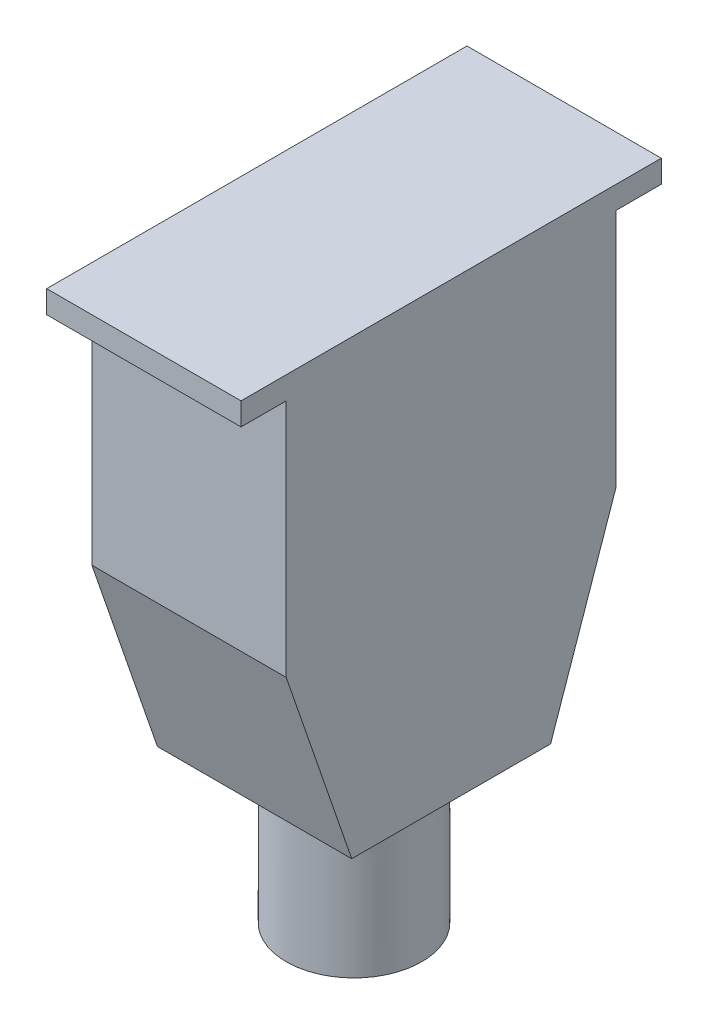
ISO-10303-21;
HEADER;
FILE_DESCRIPTION(('STEP AP214'),'2;1');
FILE_NAME('part.step','',(''),(''),'','','');
FILE_SCHEMA(('AUTOMOTIVE_DESIGN { 1 0 10303 214 1 1 1 1 }'));
ENDSEC;
DATA;
#1=APPLICATION_CONTEXT('core data for automotive mechanical design processes');
#2=APPLICATION_PROTOCOL_DEFINITION('international standard','automotive_design',2000,#1);
#3=PRODUCT_CONTEXT('',#1,'mechanical');
#4=PRODUCT('Part','Part','',(#3));
#5=PRODUCT_RELATED_PRODUCT_CATEGORY('part','',(#4));
#6=PRODUCT_DEFINITION_FORMATION('','',#4);
#7=PRODUCT_DEFINITION_CONTEXT('part definition',#1,'design');
#8=PRODUCT_DEFINITION('design','',#6,#7);
#9=PRODUCT_DEFINITION_SHAPE('','',#8);
#10=(LENGTH_UNIT() NAMED_UNIT(*) SI_UNIT(.MILLI.,.METRE.));
#11=(NAMED_UNIT(*) PLANE_ANGLE_UNIT() SI_UNIT($,.RADIAN.));
#12=(NAMED_UNIT(*) SI_UNIT($,.STERADIAN.) SOLID_ANGLE_UNIT());
#13=UNCERTAINTY_MEASURE_WITH_UNIT(LENGTH_MEASURE(1.E-05),#10,'distance_accuracy_value','');
#14=(GEOMETRIC_REPRESENTATION_CONTEXT(3) GLOBAL_UNCERTAINTY_ASSIGNED_CONTEXT((#13)) GLOBAL_UNIT_ASSIGNED_CONTEXT((#10,
#11,#12)) REPRESENTATION_CONTEXT('',''));
#15=CARTESIAN_POINT('',(0.,0.,0.));
#16=DIRECTION('',(0.,0.,1.));
#17=DIRECTION('',(1.,0.,0.));
#18=AXIS2_PLACEMENT_3D('',#15,#16,#17);
#19=CARTESIAN_POINT('',(173.,-7.6,65.));
#20=DIRECTION('',(0.,-1.,0.));
#21=DIRECTION('',(0.,0.,-1.));
#22=AXIS2_PLACEMENT_3D('',#19,#20,#21);
#23=PLANE('',#22);
#24=DIRECTION('',(-1.,0.,0.));
#25=VECTOR('',#24,1.);
#26=CARTESIAN_POINT('',(194.5,-7.6,101.5));
#27=LINE('',#26,#25);
#28=CARTESIAN_POINT('',(194.5,-7.6,101.5));
#29=VERTEX_POINT('',#28);
#30=CARTESIAN_POINT('',(151.5,-7.6,101.5));
#31=VERTEX_POINT('',#30);
#32=EDGE_CURVE('E34',#29,#31,#27,.T.);
#33=ORIENTED_EDGE('',*,*,#32,.F.);
#34=DIRECTION('',(0.,0.,1.));
#35=VECTOR('',#34,1.);
#36=CARTESIAN_POINT('',(194.5,-7.6,18.5));
#37=LINE('',#36,#35);
#38=CARTESIAN_POINT('',(194.5,-7.6,111.5));
#39=VERTEX_POINT('',#38);
#40=EDGE_CURVE('E143',#29,#39,#37,.T.);
#41=ORIENTED_EDGE('',*,*,#40,.T.);
#42=DIRECTION('',(-1.,0.,0.));
#43=VECTOR('',#42,1.);
#44=CARTESIAN_POINT('',(194.5,-7.6,111.5));
#45=LINE('',#44,#43);
#46=CARTESIAN_POINT('',(151.5,-7.6,111.5));
#47=VERTEX_POINT('',#46);
#48=EDGE_CURVE('E112',#39,#47,#45,.T.);
#49=ORIENTED_EDGE('',*,*,#48,.T.);
#50=DIRECTION('',(0.,0.,-1.));
#51=VECTOR('',#50,1.);
#52=CARTESIAN_POINT('',(151.5,-7.6,111.5));
#53=LINE('',#52,#51);
#54=EDGE_CURVE('E129',#47,#31,#53,.T.);
#55=ORIENTED_EDGE('',*,*,#54,.T.);
#56=EDGE_LOOP('',(#33,#41,#49,#55));
#57=FACE_BOUND('',#56,.T.);
#58=ADVANCED_FACE('F17',(#57),#23,.T.);
#59=CARTESIAN_POINT('',(151.5,-7.6,111.5));
#60=DIRECTION('',(1.,0.,0.));
#61=DIRECTION('',(0.,0.,-1.));
#62=AXIS2_PLACEMENT_3D('',#59,#60,#61);
#63=PLANE('',#62);
#64=DIRECTION('',(0.,0.,-1.));
#65=VECTOR('',#64,1.);
#66=CARTESIAN_POINT('',(151.5,-2.6,111.5));
#67=LINE('',#66,#65);
#68=CARTESIAN_POINT('',(151.5,-2.6,111.5));
#69=VERTEX_POINT('',#68);
#70=CARTESIAN_POINT('',(151.5,-2.6,18.5));
#71=VERTEX_POINT('',#70);
#72=EDGE_CURVE('E102',#69,#71,#67,.T.);
#73=ORIENTED_EDGE('',*,*,#72,.T.);
#74=DIRECTION('',(0.,1.,0.));
#75=VECTOR('',#74,1.);
#76=CARTESIAN_POINT('',(151.5,-7.6,18.5));
#77=LINE('',#76,#75);
#78=CARTESIAN_POINT('',(151.5,-7.6,18.5));
#79=VERTEX_POINT('',#78);
#80=EDGE_CURVE('E11',#79,#71,#77,.T.);
#81=ORIENTED_EDGE('',*,*,#80,.F.);
#82=CARTESIAN_POINT('',(151.5,-7.6,28.5));
#83=VERTEX_POINT('',#82);
#84=EDGE_CURVE('E106',#83,#79,#53,.T.);
#85=ORIENTED_EDGE('',*,*,#84,.F.);
#86=DIRECTION('',(0.,1.,0.));
#87=VECTOR('',#86,1.);
#88=CARTESIAN_POINT('',(151.5,-31.1,28.5));
#89=LINE('',#88,#87);
#90=CARTESIAN_POINT('',(151.5,-60.6,28.5));
#91=VERTEX_POINT('',#90);
#92=EDGE_CURVE('E126',#91,#83,#89,.T.);
#93=ORIENTED_EDGE('',*,*,#92,.F.);
#94=DIRECTION('',(0.,0.945253332301009,-0.326337459961063));
#95=VECTOR('',#94,1.);
#96=CARTESIAN_POINT('',(151.5,-11.0530834494112,11.3945169051538));
#97=LINE('',#96,#95);
#98=CARTESIAN_POINT('',(151.5,-102.6,43.));
#99=VERTEX_POINT('',#98);
#100=EDGE_CURVE('E189',#99,#91,#97,.T.);
#101=ORIENTED_EDGE('',*,*,#100,.F.);
#102=DIRECTION('',(0.,0.,-1.));
#103=VECTOR('',#102,1.);
#104=CARTESIAN_POINT('',(151.5,-102.6,101.5));
#105=LINE('',#104,#103);
#106=CARTESIAN_POINT('',(151.5,-102.6,87.));
#107=VERTEX_POINT('',#106);
#108=EDGE_CURVE('E187',#107,#99,#105,.T.);
#109=ORIENTED_EDGE('',*,*,#108,.F.);
#110=DIRECTION('',(0.,0.945253332301009,0.326337459961063));
#111=VECTOR('',#110,1.);
#112=CARTESIAN_POINT('',(151.5,-39.7409395973155,108.701342281879));
#113=LINE('',#112,#111);
#114=CARTESIAN_POINT('',(151.5,-60.6,101.5));
#115=VERTEX_POINT('',#114);
#116=EDGE_CURVE('E195',#107,#115,#113,.T.);
#117=ORIENTED_EDGE('',*,*,#116,.T.);
#118=DIRECTION('',(0.,1.,0.));
#119=VECTOR('',#118,1.);
#120=CARTESIAN_POINT('',(151.5,-31.1,101.5));
#121=LINE('',#120,#119);
#122=EDGE_CURVE('E163',#115,#31,#121,.T.);
#123=ORIENTED_EDGE('',*,*,#122,.T.);
#124=ORIENTED_EDGE('',*,*,#54,.F.);
#125=DIRECTION('',(0.,1.,0.));
#126=VECTOR('',#125,1.);
#127=CARTESIAN_POINT('',(151.5,-7.6,111.5));
#128=LINE('',#127,#126);
#129=EDGE_CURVE('E114',#47,#69,#128,.T.);
#130=ORIENTED_EDGE('',*,*,#129,.T.);
#131=EDGE_LOOP('',(#73,#81,#85,#93,#101,#109,#117,#123,#124,#130));
#132=FACE_BOUND('',#131,.T.);
#133=ADVANCED_FACE('F19',(#132),#63,.F.);
#134=CARTESIAN_POINT('',(151.5,-7.6,18.5));
#135=DIRECTION('',(0.,0.,1.));
#136=DIRECTION('',(1.,0.,0.));
#137=AXIS2_PLACEMENT_3D('',#134,#135,#136);
#138=PLANE('',#137);
#139=DIRECTION('',(1.,0.,0.));
#140=VECTOR('',#139,1.);
#141=CARTESIAN_POINT('',(151.5,-2.6,18.5));
#142=LINE('',#141,#140);
#143=CARTESIAN_POINT('',(194.5,-2.6,18.5));
#144=VERTEX_POINT('',#143);
#145=EDGE_CURVE('E120',#71,#144,#142,.T.);
#146=ORIENTED_EDGE('',*,*,#145,.T.);
#147=DIRECTION('',(0.,1.,0.));
#148=VECTOR('',#147,1.);
#149=CARTESIAN_POINT('',(194.5,-7.6,18.5));
#150=LINE('',#149,#148);
#151=CARTESIAN_POINT('',(194.5,-7.6,18.5));
#152=VERTEX_POINT('',#151);
#153=EDGE_CURVE('E26',#152,#144,#150,.T.);
#154=ORIENTED_EDGE('',*,*,#153,.F.);
#155=DIRECTION('',(1.,0.,0.));
#156=VECTOR('',#155,1.);
#157=CARTESIAN_POINT('',(151.5,-7.6,18.5));
#158=LINE('',#157,#156);
#159=EDGE_CURVE('E131',#79,#152,#158,.T.);
#160=ORIENTED_EDGE('',*,*,#159,.F.);
#161=ORIENTED_EDGE('',*,*,#80,.T.);
#162=EDGE_LOOP('',(#146,#154,#160,#161));
#163=FACE_BOUND('',#162,.T.);
#164=ADVANCED_FACE('F149',(#163),#138,.F.);
#165=CARTESIAN_POINT('',(194.5,-7.6,18.5));
#166=DIRECTION('',(-1.,0.,0.));
#167=DIRECTION('',(0.,0.,1.));
#168=AXIS2_PLACEMENT_3D('',#165,#166,#167);
#169=PLANE('',#168);
#170=DIRECTION('',(0.,0.,1.));
#171=VECTOR('',#170,1.);
#172=CARTESIAN_POINT('',(194.5,-2.6,18.5));
#173=LINE('',#172,#171);
#174=CARTESIAN_POINT('',(194.5,-2.6,111.5));
#175=VERTEX_POINT('',#174);
#176=EDGE_CURVE('E99',#144,#175,#173,.T.);
#177=ORIENTED_EDGE('',*,*,#176,.T.);
#178=DIRECTION('',(0.,1.,0.));
#179=VECTOR('',#178,1.);
#180=CARTESIAN_POINT('',(194.5,-7.6,111.5));
#181=LINE('',#180,#179);
#182=EDGE_CURVE('E110',#39,#175,#181,.T.);
#183=ORIENTED_EDGE('',*,*,#182,.F.);
#184=ORIENTED_EDGE('',*,*,#40,.F.);
#185=DIRECTION('',(0.,1.,0.));
#186=VECTOR('',#185,1.);
#187=CARTESIAN_POINT('',(194.5,-31.1,101.5));
#188=LINE('',#187,#186);
#189=CARTESIAN_POINT('',(194.5,-60.6,101.5));
#190=VERTEX_POINT('',#189);
#191=EDGE_CURVE('E158',#190,#29,#188,.T.);
#192=ORIENTED_EDGE('',*,*,#191,.F.);
#193=DIRECTION('',(0.,-0.945253332301009,-0.326337459961063));
#194=VECTOR('',#193,1.);
#195=CARTESIAN_POINT('',(194.5,-60.6,101.5));
#196=LINE('',#195,#194);
#197=CARTESIAN_POINT('',(194.5,-102.6,87.));
#198=VERTEX_POINT('',#197);
#199=EDGE_CURVE('E201',#190,#198,#196,.T.);
#200=ORIENTED_EDGE('',*,*,#199,.T.);
#201=DIRECTION('',(0.,0.,1.));
#202=VECTOR('',#201,1.);
#203=CARTESIAN_POINT('',(194.5,-102.6,28.5));
#204=LINE('',#203,#202);
#205=CARTESIAN_POINT('',(194.5,-102.6,43.));
#206=VERTEX_POINT('',#205);
#207=EDGE_CURVE('E184',#206,#198,#204,.T.);
#208=ORIENTED_EDGE('',*,*,#207,.F.);
#209=DIRECTION('',(0.,-0.945253332301009,0.326337459961063));
#210=VECTOR('',#209,1.);
#211=CARTESIAN_POINT('',(194.5,-60.6,28.5));
#212=LINE('',#211,#210);
#213=CARTESIAN_POINT('',(194.5,-60.6,28.5));
#214=VERTEX_POINT('',#213);
#215=EDGE_CURVE('E154',#214,#206,#212,.T.);
#216=ORIENTED_EDGE('',*,*,#215,.F.);
#217=DIRECTION('',(0.,1.,0.));
#218=VECTOR('',#217,1.);
#219=CARTESIAN_POINT('',(194.5,-31.1,28.5));
#220=LINE('',#219,#218);
#221=CARTESIAN_POINT('',(194.5,-7.6,28.5));
#222=VERTEX_POINT('',#221);
#223=EDGE_CURVE('E152',#214,#222,#220,.T.);
#224=ORIENTED_EDGE('',*,*,#223,.T.);
#225=EDGE_CURVE('E137',#152,#222,#37,.T.);
#226=ORIENTED_EDGE('',*,*,#225,.F.);
#227=ORIENTED_EDGE('',*,*,#153,.T.);
#228=EDGE_LOOP('',(#177,#183,#184,#192,#200,#208,#216,#224,#226,#227));
#229=FACE_BOUND('',#228,.T.);
#230=ADVANCED_FACE('F117',(#229),#169,.F.);
#231=CARTESIAN_POINT('',(194.5,-7.6,111.5));
#232=DIRECTION('',(0.,0.,-1.));
#233=DIRECTION('',(-1.,0.,0.));
#234=AXIS2_PLACEMENT_3D('',#231,#232,#233);
#235=PLANE('',#234);
#236=DIRECTION('',(-1.,0.,0.));
#237=VECTOR('',#236,1.);
#238=CARTESIAN_POINT('',(194.5,-2.6,111.5));
#239=LINE('',#238,#237);
#240=EDGE_CURVE('E95',#175,#69,#239,.T.);
#241=ORIENTED_EDGE('',*,*,#240,.T.);
#242=ORIENTED_EDGE('',*,*,#129,.F.);
#243=ORIENTED_EDGE('',*,*,#48,.F.);
#244=ORIENTED_EDGE('',*,*,#182,.T.);
#245=EDGE_LOOP('',(#241,#242,#243,#244));
#246=FACE_BOUND('',#245,.T.);
#247=ADVANCED_FACE('F111',(#246),#235,.F.);
#248=DIRECTION('',(1.,0.,0.));
#249=VECTOR('',#248,1.);
#250=CARTESIAN_POINT('',(151.5,-7.6,28.5));
#251=LINE('',#250,#249);
#252=EDGE_CURVE('E42',#83,#222,#251,.T.);
#253=ORIENTED_EDGE('',*,*,#252,.F.);
#254=ORIENTED_EDGE('',*,*,#84,.T.);
#255=ORIENTED_EDGE('',*,*,#159,.T.);
#256=ORIENTED_EDGE('',*,*,#225,.T.);
#257=EDGE_LOOP('',(#253,#254,#255,#256));
#258=FACE_BOUND('',#257,.T.);
#259=ADVANCED_FACE('F146',(#258),#23,.T.);
#260=CARTESIAN_POINT('',(151.5,-31.1,28.5));
#261=DIRECTION('',(0.,0.,1.));
#262=DIRECTION('',(1.,0.,0.));
#263=AXIS2_PLACEMENT_3D('',#260,#261,#262);
#264=PLANE('',#263);
#265=ORIENTED_EDGE('',*,*,#252,.T.);
#266=ORIENTED_EDGE('',*,*,#223,.F.);
#267=DIRECTION('',(1.,0.,0.));
#268=VECTOR('',#267,1.);
#269=CARTESIAN_POINT('',(51.3286938663577,-60.6,28.5));
#270=LINE('',#269,#268);
#271=EDGE_CURVE('E192',#91,#214,#270,.T.);
#272=ORIENTED_EDGE('',*,*,#271,.F.);
#273=ORIENTED_EDGE('',*,*,#92,.T.);
#274=EDGE_LOOP('',(#265,#266,#272,#273));
#275=FACE_BOUND('',#274,.T.);
#276=ADVANCED_FACE('F231',(#275),#264,.F.);
#277=CARTESIAN_POINT('',(194.5,-31.1,101.5));
#278=DIRECTION('',(0.,0.,-1.));
#279=DIRECTION('',(-1.,0.,0.));
#280=AXIS2_PLACEMENT_3D('',#277,#278,#279);
#281=PLANE('',#280);
#282=ORIENTED_EDGE('',*,*,#32,.T.);
#283=ORIENTED_EDGE('',*,*,#122,.F.);
#284=DIRECTION('',(1.,0.,0.));
#285=VECTOR('',#284,1.);
#286=CARTESIAN_POINT('',(51.3286938663577,-60.6,101.5));
#287=LINE('',#286,#285);
#288=EDGE_CURVE('E198',#115,#190,#287,.T.);
#289=ORIENTED_EDGE('',*,*,#288,.T.);
#290=ORIENTED_EDGE('',*,*,#191,.T.);
#291=EDGE_LOOP('',(#282,#283,#289,#290));
#292=FACE_BOUND('',#291,.T.);
#293=ADVANCED_FACE('F236',(#292),#281,.F.);
#294=CARTESIAN_POINT('',(173.,-102.6,65.));
#295=DIRECTION('',(0.,-1.,0.));
#296=DIRECTION('',(1.,0.,0.));
#297=AXIS2_PLACEMENT_3D('',#294,#295,#296);
#298=PLANE('',#297);
#299=CARTESIAN_POINT('',(173.,-102.6,65.));
#300=DIRECTION('',(0.,-1.,0.));
#301=DIRECTION('',(1.,0.,0.));
#302=AXIS2_PLACEMENT_3D('',#299,#300,#301);
#303=CIRCLE('',#302,15.);
#304=CARTESIAN_POINT('',(188.,-102.6,65.));
#305=VERTEX_POINT('',#304);
#306=EDGE_CURVE('E175',#305,#305,#303,.T.);
#307=ORIENTED_EDGE('',*,*,#306,.F.);
#308=EDGE_LOOP('',(#307));
#309=FACE_BOUND('',#308,.T.);
#310=ORIENTED_EDGE('',*,*,#207,.T.);
#311=DIRECTION('',(-1.,0.,0.));
#312=VECTOR('',#311,1.);
#313=CARTESIAN_POINT('',(173.,-102.6,87.));
#314=LINE('',#313,#312);
#315=EDGE_CURVE('E178',#198,#107,#314,.T.);
#316=ORIENTED_EDGE('',*,*,#315,.T.);
#317=ORIENTED_EDGE('',*,*,#108,.T.);
#318=DIRECTION('',(-1.,0.,0.));
#319=VECTOR('',#318,1.);
#320=CARTESIAN_POINT('',(173.,-102.6,43.));
#321=LINE('',#320,#319);
#322=EDGE_CURVE('E181',#206,#99,#321,.T.);
#323=ORIENTED_EDGE('',*,*,#322,.F.);
#324=EDGE_LOOP('',(#310,#316,#317,#323));
#325=FACE_BOUND('',#324,.T.);
#326=ADVANCED_FACE('F285',(#309,#325),#298,.T.);
#327=CARTESIAN_POINT('',(51.3286938663577,-60.6,28.5));
#328=DIRECTION('',(0.,0.326337459961063,0.945253332301009));
#329=DIRECTION('',(0.,-0.945253332301009,0.326337459961063));
#330=AXIS2_PLACEMENT_3D('',#327,#328,#329);
#331=PLANE('',#330);
#332=ORIENTED_EDGE('',*,*,#100,.T.);
#333=ORIENTED_EDGE('',*,*,#271,.T.);
#334=ORIENTED_EDGE('',*,*,#215,.T.);
#335=ORIENTED_EDGE('',*,*,#322,.T.);
#336=EDGE_LOOP('',(#332,#333,#334,#335));
#337=FACE_BOUND('',#336,.T.);
#338=ADVANCED_FACE('F296',(#337),#331,.F.);
#339=CARTESIAN_POINT('',(51.3286938663577,-60.6,101.5));
#340=DIRECTION('',(0.,-0.326337459961063,0.945253332301009));
#341=DIRECTION('',(0.,-0.945253332301009,-0.326337459961063));
#342=AXIS2_PLACEMENT_3D('',#339,#340,#341);
#343=PLANE('',#342);
#344=ORIENTED_EDGE('',*,*,#315,.F.);
#345=ORIENTED_EDGE('',*,*,#199,.F.);
#346=ORIENTED_EDGE('',*,*,#288,.F.);
#347=ORIENTED_EDGE('',*,*,#116,.F.);
#348=EDGE_LOOP('',(#344,#345,#346,#347));
#349=FACE_BOUND('',#348,.T.);
#350=ADVANCED_FACE('F220',(#349),#343,.T.);
#351=CARTESIAN_POINT('',(173.,-136.6,65.));
#352=DIRECTION('',(0.,1.,0.));
#353=DIRECTION('',(-1.,0.,0.));
#354=AXIS2_PLACEMENT_3D('',#351,#352,#353);
#355=CYLINDRICAL_SURFACE('',#354,15.);
#356=CARTESIAN_POINT('',(173.,-136.6,65.));
#357=DIRECTION('',(0.,1.,0.));
#358=DIRECTION('',(-1.,0.,0.));
#359=AXIS2_PLACEMENT_3D('',#356,#357,#358);
#360=CIRCLE('',#359,15.);
#361=CARTESIAN_POINT('',(158.,-136.6,65.));
#362=VERTEX_POINT('',#361);
#363=EDGE_CURVE('E204',#362,#362,#360,.T.);
#364=ORIENTED_EDGE('',*,*,#363,.T.);
#365=EDGE_LOOP('',(#364));
#366=FACE_BOUND('',#365,.T.);
#367=ORIENTED_EDGE('',*,*,#306,.T.);
#368=EDGE_LOOP('',(#367));
#369=FACE_BOUND('',#368,.T.);
#370=ADVANCED_FACE('F208',(#366,#369),#355,.T.);
#371=CARTESIAN_POINT('',(173.,-136.6,65.));
#372=DIRECTION('',(0.,1.,0.));
#373=DIRECTION('',(-1.,0.,0.));
#374=AXIS2_PLACEMENT_3D('',#371,#372,#373);
#375=PLANE('',#374);
#376=ORIENTED_EDGE('',*,*,#363,.F.);
#377=EDGE_LOOP('',(#376));
#378=FACE_BOUND('',#377,.T.);
#379=ADVANCED_FACE('F211',(#378),#375,.F.);
#380=CARTESIAN_POINT('',(0.,-2.6,0.));
#381=DIRECTION('',(0.,1.,0.));
#382=DIRECTION('',(0.,0.,1.));
#383=AXIS2_PLACEMENT_3D('',#380,#381,#382);
#384=PLANE('',#383);
#385=ORIENTED_EDGE('',*,*,#72,.F.);
#386=ORIENTED_EDGE('',*,*,#240,.F.);
#387=ORIENTED_EDGE('',*,*,#176,.F.);
#388=ORIENTED_EDGE('',*,*,#145,.F.);
#389=EDGE_LOOP('',(#385,#386,#387,#388));
#390=FACE_BOUND('',#389,.T.);
#391=ADVANCED_FACE('F97',(#390),#384,.T.);
#392=CLOSED_SHELL('',(#58,#133,#164,#230,#247,#259,#276,#293,#326,#338,#350,#370,#379,#391));
#393=MANIFOLD_SOLID_BREP('B1',#392);
#394=ADVANCED_BREP_SHAPE_REPRESENTATION('',(#18,#393),#14);
#395=SHAPE_DEFINITION_REPRESENTATION(#9,#394);
ENDSEC;
END-ISO-10303-21;
